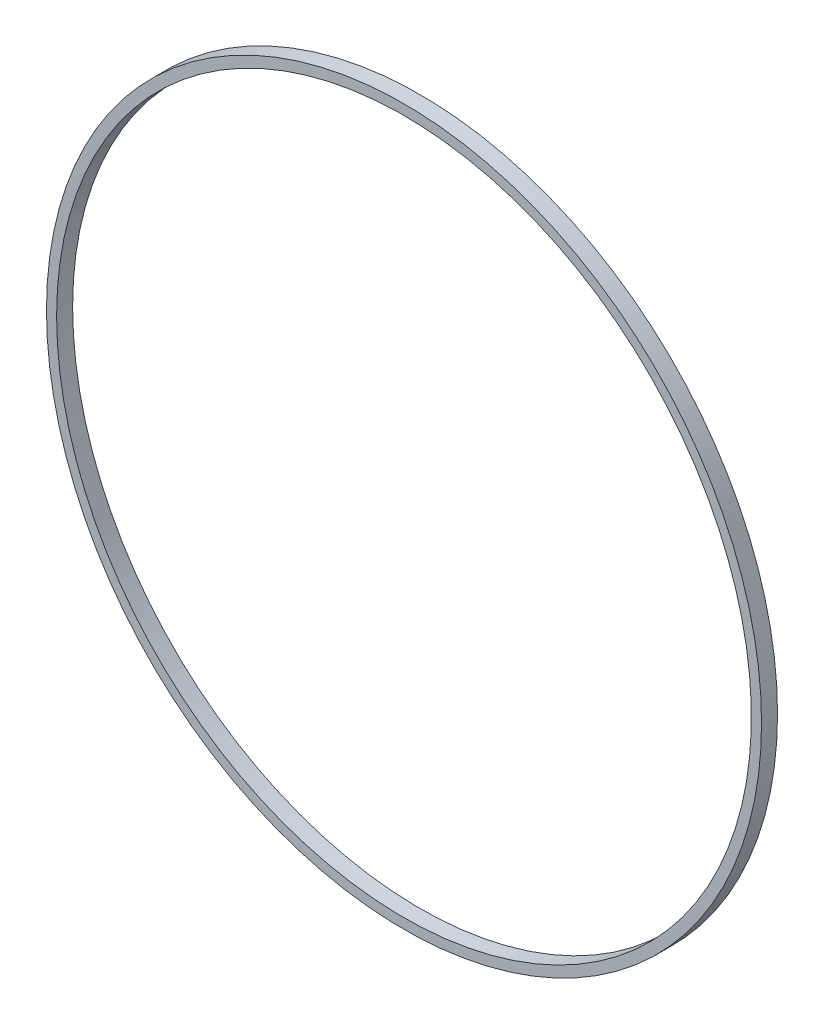
ISO-10303-21;
HEADER;
FILE_DESCRIPTION(('STEP AP214'),'2;1');
FILE_NAME('part.step','',(''),(''),'','','');
FILE_SCHEMA(('AUTOMOTIVE_DESIGN { 1 0 10303 214 1 1 1 1 }'));
ENDSEC;
DATA;
#1=APPLICATION_CONTEXT('core data for automotive mechanical design processes');
#2=APPLICATION_PROTOCOL_DEFINITION('international standard','automotive_design',2000,#1);
#3=PRODUCT_CONTEXT('',#1,'mechanical');
#4=PRODUCT('Part','Part','',(#3));
#5=PRODUCT_RELATED_PRODUCT_CATEGORY('part','',(#4));
#6=PRODUCT_DEFINITION_FORMATION('','',#4);
#7=PRODUCT_DEFINITION_CONTEXT('part definition',#1,'design');
#8=PRODUCT_DEFINITION('design','',#6,#7);
#9=PRODUCT_DEFINITION_SHAPE('','',#8);
#10=(LENGTH_UNIT() NAMED_UNIT(*) SI_UNIT(.MILLI.,.METRE.));
#11=(NAMED_UNIT(*) PLANE_ANGLE_UNIT() SI_UNIT($,.RADIAN.));
#12=(NAMED_UNIT(*) SI_UNIT($,.STERADIAN.) SOLID_ANGLE_UNIT());
#13=UNCERTAINTY_MEASURE_WITH_UNIT(LENGTH_MEASURE(1.E-05),#10,'distance_accuracy_value','');
#14=(GEOMETRIC_REPRESENTATION_CONTEXT(3) GLOBAL_UNCERTAINTY_ASSIGNED_CONTEXT((#13)) GLOBAL_UNIT_ASSIGNED_CONTEXT((#10,
#11,#12)) REPRESENTATION_CONTEXT('',''));
#15=CARTESIAN_POINT('',(0.,0.,0.));
#16=DIRECTION('',(0.,0.,1.));
#17=DIRECTION('',(1.,0.,0.));
#18=AXIS2_PLACEMENT_3D('',#15,#16,#17);
#19=CARTESIAN_POINT('',(-0.656076706078406,7.66556790179518,2.6022646914851));
#20=DIRECTION('',(0.,0.,1.));
#21=DIRECTION('',(-1.,0.,0.));
#22=AXIS2_PLACEMENT_3D('',#19,#20,#21);
#23=PLANE('',#22);
#24=CARTESIAN_POINT('',(-0.656076706078406,7.66556790179518,2.6022646914851));
#25=DIRECTION('',(0.,0.,-1.));
#26=DIRECTION('',(-1.,0.,0.));
#27=AXIS2_PLACEMENT_3D('',#24,#25,#26);
#28=CIRCLE('',#27,6.50999999999936);
#29=CARTESIAN_POINT('',(-7.16607670607777,7.66556790179518,2.6022646914851));
#30=VERTEX_POINT('',#29);
#31=EDGE_CURVE('E49',#30,#30,#28,.F.);
#32=ORIENTED_EDGE('',*,*,#31,.F.);
#33=EDGE_LOOP('',(#32));
#34=FACE_BOUND('',#33,.T.);
#35=CARTESIAN_POINT('',(-0.6560767060812,7.66556790179518,2.6022646914851));
#36=DIRECTION('',(0.,0.,-1.));
#37=DIRECTION('',(-1.,0.,0.));
#38=AXIS2_PLACEMENT_3D('',#35,#36,#37);
#39=CIRCLE('',#38,6.70000000000114);
#40=CARTESIAN_POINT('',(-7.35607670608234,7.66556790179518,2.6022646914851));
#41=VERTEX_POINT('',#40);
#42=EDGE_CURVE('E40',#41,#41,#39,.F.);
#43=ORIENTED_EDGE('',*,*,#42,.T.);
#44=EDGE_LOOP('',(#43));
#45=FACE_BOUND('',#44,.T.);
#46=ADVANCED_FACE('F37',(#34,#45),#23,.T.);
#47=CARTESIAN_POINT('',(-0.6560767060812,7.66556790179518,2.30226469148554));
#48=DIRECTION('',(0.,0.,1.));
#49=DIRECTION('',(-1.,0.,0.));
#50=AXIS2_PLACEMENT_3D('',#47,#48,#49);
#51=CYLINDRICAL_SURFACE('',#50,6.70000000000114);
#52=CARTESIAN_POINT('',(-0.6560767060812,7.66556790179518,2.30226469148554));
#53=DIRECTION('',(0.,0.,-1.));
#54=DIRECTION('',(-1.,0.,0.));
#55=AXIS2_PLACEMENT_3D('',#52,#53,#54);
#56=CIRCLE('',#55,6.70000000000114);
#57=CARTESIAN_POINT('',(-7.35607670608234,7.66556790179518,2.30226469148554));
#58=VERTEX_POINT('',#57);
#59=EDGE_CURVE('E44',#58,#58,#56,.F.);
#60=ORIENTED_EDGE('',*,*,#59,.T.);
#61=EDGE_LOOP('',(#60));
#62=FACE_BOUND('',#61,.T.);
#63=ORIENTED_EDGE('',*,*,#42,.F.);
#64=EDGE_LOOP('',(#63));
#65=FACE_BOUND('',#64,.T.);
#66=ADVANCED_FACE('F58',(#62,#65),#51,.T.);
#67=CARTESIAN_POINT('',(-0.656076706078406,7.66556790179518,2.6022646914851));
#68=DIRECTION('',(0.,0.,1.));
#69=DIRECTION('',(-1.,0.,0.));
#70=AXIS2_PLACEMENT_3D('',#67,#68,#69);
#71=CYLINDRICAL_SURFACE('',#70,6.50999999999936);
#72=ORIENTED_EDGE('',*,*,#31,.T.);
#73=EDGE_LOOP('',(#72));
#74=FACE_BOUND('',#73,.T.);
#75=CARTESIAN_POINT('',(-0.656076706078406,7.66556790179518,2.30226469148554));
#76=DIRECTION('',(0.,0.,-1.));
#77=DIRECTION('',(-1.,0.,0.));
#78=AXIS2_PLACEMENT_3D('',#75,#76,#77);
#79=CIRCLE('',#78,6.50999999999936);
#80=CARTESIAN_POINT('',(-7.16607670607777,7.66556790179518,2.30226469148554));
#81=VERTEX_POINT('',#80);
#82=EDGE_CURVE('E10',#81,#81,#79,.T.);
#83=ORIENTED_EDGE('',*,*,#82,.T.);
#84=EDGE_LOOP('',(#83));
#85=FACE_BOUND('',#84,.T.);
#86=ADVANCED_FACE('F60',(#74,#85),#71,.F.);
#87=CARTESIAN_POINT('',(-0.6560767060812,7.66556790179518,2.30226469148554));
#88=DIRECTION('',(0.,0.,-1.));
#89=DIRECTION('',(1.,0.,0.));
#90=AXIS2_PLACEMENT_3D('',#87,#88,#89);
#91=PLANE('',#90);
#92=ORIENTED_EDGE('',*,*,#82,.F.);
#93=EDGE_LOOP('',(#92));
#94=FACE_BOUND('',#93,.T.);
#95=ORIENTED_EDGE('',*,*,#59,.F.);
#96=EDGE_LOOP('',(#95));
#97=FACE_BOUND('',#96,.T.);
#98=ADVANCED_FACE('F67',(#94,#97),#91,.T.);
#99=CLOSED_SHELL('',(#46,#66,#86,#98));
#100=MANIFOLD_SOLID_BREP('B2',#99);
#101=ADVANCED_BREP_SHAPE_REPRESENTATION('',(#18,#100),#14);
#102=SHAPE_DEFINITION_REPRESENTATION(#9,#101);
ENDSEC;
END-ISO-10303-21;
